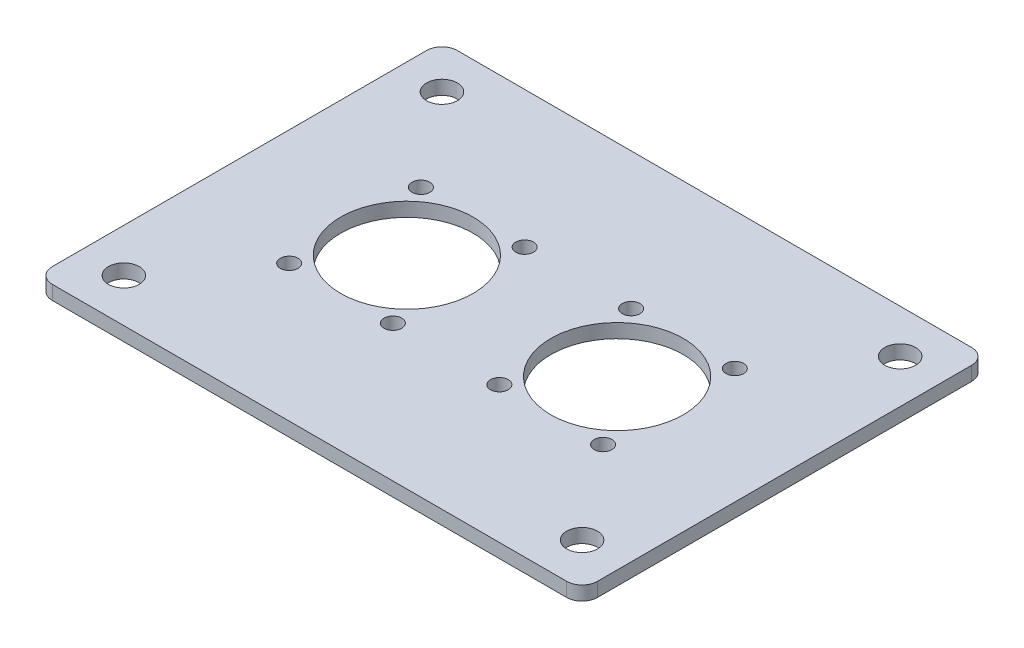
ISO-10303-21;
HEADER;
FILE_DESCRIPTION(('STEP AP214'),'2;1');
FILE_NAME('part.step','',(''),(''),'','','');
FILE_SCHEMA(('AUTOMOTIVE_DESIGN { 1 0 10303 214 1 1 1 1 }'));
ENDSEC;
DATA;
#1=APPLICATION_CONTEXT('core data for automotive mechanical design processes');
#2=APPLICATION_PROTOCOL_DEFINITION('international standard','automotive_design',2000,#1);
#3=PRODUCT_CONTEXT('',#1,'mechanical');
#4=PRODUCT('Part','Part','',(#3));
#5=PRODUCT_RELATED_PRODUCT_CATEGORY('part','',(#4));
#6=PRODUCT_DEFINITION_FORMATION('','',#4);
#7=PRODUCT_DEFINITION_CONTEXT('part definition',#1,'design');
#8=PRODUCT_DEFINITION('design','',#6,#7);
#9=PRODUCT_DEFINITION_SHAPE('','',#8);
#10=(LENGTH_UNIT() NAMED_UNIT(*) SI_UNIT(.MILLI.,.METRE.));
#11=(NAMED_UNIT(*) PLANE_ANGLE_UNIT() SI_UNIT($,.RADIAN.));
#12=(NAMED_UNIT(*) SI_UNIT($,.STERADIAN.) SOLID_ANGLE_UNIT());
#13=UNCERTAINTY_MEASURE_WITH_UNIT(LENGTH_MEASURE(1.E-05),#10,'distance_accuracy_value','');
#14=(GEOMETRIC_REPRESENTATION_CONTEXT(3) GLOBAL_UNCERTAINTY_ASSIGNED_CONTEXT((#13)) GLOBAL_UNIT_ASSIGNED_CONTEXT((#10,
#11,#12)) REPRESENTATION_CONTEXT('',''));
#15=CARTESIAN_POINT('',(0.,0.,0.));
#16=DIRECTION('',(0.,0.,1.));
#17=DIRECTION('',(1.,0.,0.));
#18=AXIS2_PLACEMENT_3D('',#15,#16,#17);
#19=CARTESIAN_POINT('',(46.609,2.54,-33.909));
#20=DIRECTION('',(0.,-1.,0.));
#21=DIRECTION('',(0.,0.,-1.));
#22=AXIS2_PLACEMENT_3D('',#19,#20,#21);
#23=PLANE('',#22);
#24=CARTESIAN_POINT('',(46.609,2.54,-33.909));
#25=DIRECTION('',(0.,1.,0.));
#26=DIRECTION('',(0.,0.,-1.));
#27=AXIS2_PLACEMENT_3D('',#24,#25,#26);
#28=CIRCLE('',#27,2.794);
#29=CARTESIAN_POINT('',(49.403,2.54,-33.909));
#30=VERTEX_POINT('',#29);
#31=CARTESIAN_POINT('',(46.609,2.54,-36.703));
#32=VERTEX_POINT('',#31);
#33=EDGE_CURVE('E166',#30,#32,#28,.T.);
#34=ORIENTED_EDGE('',*,*,#33,.T.);
#35=DIRECTION('',(-1.,0.,0.));
#36=VECTOR('',#35,1.);
#37=CARTESIAN_POINT('',(-46.609,2.54,-36.703));
#38=LINE('',#37,#36);
#39=CARTESIAN_POINT('',(-46.609,2.54,-36.703));
#40=VERTEX_POINT('',#39);
#41=EDGE_CURVE('E101',#32,#40,#38,.T.);
#42=ORIENTED_EDGE('',*,*,#41,.T.);
#43=CARTESIAN_POINT('',(-46.609,2.54,-33.909));
#44=DIRECTION('',(0.,1.,0.));
#45=DIRECTION('',(0.,0.,-1.));
#46=AXIS2_PLACEMENT_3D('',#43,#44,#45);
#47=CIRCLE('',#46,2.794);
#48=CARTESIAN_POINT('',(-49.403,2.54,-33.909));
#49=VERTEX_POINT('',#48);
#50=EDGE_CURVE('E188',#40,#49,#47,.T.);
#51=ORIENTED_EDGE('',*,*,#50,.T.);
#52=DIRECTION('',(0.,0.,1.));
#53=VECTOR('',#52,1.);
#54=CARTESIAN_POINT('',(-49.403,2.54,33.909));
#55=LINE('',#54,#53);
#56=CARTESIAN_POINT('',(-49.403,2.54,33.909));
#57=VERTEX_POINT('',#56);
#58=EDGE_CURVE('E202',#49,#57,#55,.T.);
#59=ORIENTED_EDGE('',*,*,#58,.T.);
#60=CARTESIAN_POINT('',(-46.609,2.54,33.909));
#61=DIRECTION('',(0.,1.,0.));
#62=DIRECTION('',(0.,0.,-1.));
#63=AXIS2_PLACEMENT_3D('',#60,#61,#62);
#64=CIRCLE('',#63,2.794);
#65=CARTESIAN_POINT('',(-46.609,2.54,36.703));
#66=VERTEX_POINT('',#65);
#67=EDGE_CURVE('E120',#57,#66,#64,.T.);
#68=ORIENTED_EDGE('',*,*,#67,.T.);
#69=DIRECTION('',(1.,0.,0.));
#70=VECTOR('',#69,1.);
#71=CARTESIAN_POINT('',(-46.609,2.54,36.703));
#72=LINE('',#71,#70);
#73=CARTESIAN_POINT('',(46.609,2.54,36.703));
#74=VERTEX_POINT('',#73);
#75=EDGE_CURVE('E114',#66,#74,#72,.T.);
#76=ORIENTED_EDGE('',*,*,#75,.T.);
#77=CARTESIAN_POINT('',(46.609,2.54,33.909));
#78=DIRECTION('',(0.,1.,0.));
#79=DIRECTION('',(0.,0.,1.));
#80=AXIS2_PLACEMENT_3D('',#77,#78,#79);
#81=CIRCLE('',#80,2.794);
#82=CARTESIAN_POINT('',(49.403,2.54,33.909));
#83=VERTEX_POINT('',#82);
#84=EDGE_CURVE('E118',#74,#83,#81,.T.);
#85=ORIENTED_EDGE('',*,*,#84,.T.);
#86=DIRECTION('',(0.,0.,-1.));
#87=VECTOR('',#86,1.);
#88=CARTESIAN_POINT('',(49.403,2.54,33.909));
#89=LINE('',#88,#87);
#90=EDGE_CURVE('E58',#83,#30,#89,.T.);
#91=ORIENTED_EDGE('',*,*,#90,.T.);
#92=EDGE_LOOP('',(#34,#42,#51,#59,#68,#76,#85,#91));
#93=FACE_BOUND('',#92,.T.);
#94=CARTESIAN_POINT('',(-19.05,2.54,0.));
#95=DIRECTION('',(0.,1.,0.));
#96=DIRECTION('',(0.,0.,1.));
#97=AXIS2_PLACEMENT_3D('',#94,#95,#96);
#98=CIRCLE('',#97,12.0015);
#99=CARTESIAN_POINT('',(-19.05,2.54,12.0015));
#100=VERTEX_POINT('',#99);
#101=EDGE_CURVE('E148',#100,#100,#98,.T.);
#102=ORIENTED_EDGE('',*,*,#101,.F.);
#103=EDGE_LOOP('',(#102));
#104=FACE_BOUND('',#103,.T.);
#105=CARTESIAN_POINT('',(19.05,2.54,0.));
#106=DIRECTION('',(0.,1.,0.));
#107=DIRECTION('',(0.,0.,1.));
#108=AXIS2_PLACEMENT_3D('',#105,#106,#107);
#109=CIRCLE('',#108,12.0015);
#110=CARTESIAN_POINT('',(19.05,2.54,12.0015));
#111=VERTEX_POINT('',#110);
#112=EDGE_CURVE('E217',#111,#111,#109,.T.);
#113=ORIENTED_EDGE('',*,*,#112,.F.);
#114=EDGE_LOOP('',(#113));
#115=FACE_BOUND('',#114,.T.);
#116=CARTESIAN_POINT('',(-41.529,2.54,-28.829));
#117=DIRECTION('',(0.,1.,0.));
#118=DIRECTION('',(0.,0.,1.));
#119=AXIS2_PLACEMENT_3D('',#116,#117,#118);
#120=CIRCLE('',#119,2.794);
#121=CARTESIAN_POINT('',(-41.529,2.54,-26.035));
#122=VERTEX_POINT('',#121);
#123=EDGE_CURVE('E225',#122,#122,#120,.T.);
#124=ORIENTED_EDGE('',*,*,#123,.F.);
#125=EDGE_LOOP('',(#124));
#126=FACE_BOUND('',#125,.T.);
#127=CARTESIAN_POINT('',(-28.448,2.54,11.938));
#128=DIRECTION('',(0.,1.,0.));
#129=DIRECTION('',(0.,0.,1.));
#130=AXIS2_PLACEMENT_3D('',#127,#128,#129);
#131=CIRCLE('',#130,1.6002);
#132=CARTESIAN_POINT('',(-28.448,2.54,13.5382));
#133=VERTEX_POINT('',#132);
#134=EDGE_CURVE('E233',#133,#133,#131,.T.);
#135=ORIENTED_EDGE('',*,*,#134,.F.);
#136=EDGE_LOOP('',(#135));
#137=FACE_BOUND('',#136,.T.);
#138=CARTESIAN_POINT('',(9.652,2.54,11.938));
#139=DIRECTION('',(0.,1.,0.));
#140=DIRECTION('',(0.,0.,1.));
#141=AXIS2_PLACEMENT_3D('',#138,#139,#140);
#142=CIRCLE('',#141,1.6002);
#143=CARTESIAN_POINT('',(9.652,2.54,13.5382));
#144=VERTEX_POINT('',#143);
#145=EDGE_CURVE('E241',#144,#144,#142,.T.);
#146=ORIENTED_EDGE('',*,*,#145,.F.);
#147=EDGE_LOOP('',(#146));
#148=FACE_BOUND('',#147,.T.);
#149=CARTESIAN_POINT('',(-9.652,2.54,11.938));
#150=DIRECTION('',(0.,1.,0.));
#151=DIRECTION('',(0.,0.,1.));
#152=AXIS2_PLACEMENT_3D('',#149,#150,#151);
#153=CIRCLE('',#152,1.6002);
#154=CARTESIAN_POINT('',(-9.652,2.54,13.5382));
#155=VERTEX_POINT('',#154);
#156=EDGE_CURVE('E249',#155,#155,#153,.T.);
#157=ORIENTED_EDGE('',*,*,#156,.F.);
#158=EDGE_LOOP('',(#157));
#159=FACE_BOUND('',#158,.T.);
#160=CARTESIAN_POINT('',(-9.65200000000008,2.54,-11.938));
#161=DIRECTION('',(0.,1.,0.));
#162=DIRECTION('',(0.,0.,1.));
#163=AXIS2_PLACEMENT_3D('',#160,#161,#162);
#164=CIRCLE('',#163,1.6002);
#165=CARTESIAN_POINT('',(-9.65200000000008,2.54,-10.3378));
#166=VERTEX_POINT('',#165);
#167=EDGE_CURVE('E257',#166,#166,#164,.T.);
#168=ORIENTED_EDGE('',*,*,#167,.F.);
#169=EDGE_LOOP('',(#168));
#170=FACE_BOUND('',#169,.T.);
#171=CARTESIAN_POINT('',(-28.4480000000001,2.54,-11.938));
#172=DIRECTION('',(0.,1.,0.));
#173=DIRECTION('',(0.,0.,1.));
#174=AXIS2_PLACEMENT_3D('',#171,#172,#173);
#175=CIRCLE('',#174,1.6002);
#176=CARTESIAN_POINT('',(-28.4480000000001,2.54,-10.3378));
#177=VERTEX_POINT('',#176);
#178=EDGE_CURVE('E265',#177,#177,#175,.T.);
#179=ORIENTED_EDGE('',*,*,#178,.F.);
#180=EDGE_LOOP('',(#179));
#181=FACE_BOUND('',#180,.T.);
#182=CARTESIAN_POINT('',(28.448,2.54,11.938));
#183=DIRECTION('',(0.,1.,0.));
#184=DIRECTION('',(0.,0.,1.));
#185=AXIS2_PLACEMENT_3D('',#182,#183,#184);
#186=CIRCLE('',#185,1.6002);
#187=CARTESIAN_POINT('',(28.448,2.54,13.5382));
#188=VERTEX_POINT('',#187);
#189=EDGE_CURVE('E273',#188,#188,#186,.T.);
#190=ORIENTED_EDGE('',*,*,#189,.F.);
#191=EDGE_LOOP('',(#190));
#192=FACE_BOUND('',#191,.T.);
#193=CARTESIAN_POINT('',(28.4479999999999,2.54,-11.938));
#194=DIRECTION('',(0.,1.,0.));
#195=DIRECTION('',(0.,0.,1.));
#196=AXIS2_PLACEMENT_3D('',#193,#194,#195);
#197=CIRCLE('',#196,1.6002);
#198=CARTESIAN_POINT('',(28.4479999999999,2.54,-10.3378));
#199=VERTEX_POINT('',#198);
#200=EDGE_CURVE('E281',#199,#199,#197,.T.);
#201=ORIENTED_EDGE('',*,*,#200,.F.);
#202=EDGE_LOOP('',(#201));
#203=FACE_BOUND('',#202,.T.);
#204=CARTESIAN_POINT('',(9.65199999999992,2.54,-11.938));
#205=DIRECTION('',(0.,1.,0.));
#206=DIRECTION('',(0.,0.,1.));
#207=AXIS2_PLACEMENT_3D('',#204,#205,#206);
#208=CIRCLE('',#207,1.6002);
#209=CARTESIAN_POINT('',(9.65199999999992,2.54,-10.3378));
#210=VERTEX_POINT('',#209);
#211=EDGE_CURVE('E289',#210,#210,#208,.T.);
#212=ORIENTED_EDGE('',*,*,#211,.F.);
#213=EDGE_LOOP('',(#212));
#214=FACE_BOUND('',#213,.T.);
#215=CARTESIAN_POINT('',(41.529,2.54,-28.829));
#216=DIRECTION('',(0.,1.,0.));
#217=DIRECTION('',(0.,0.,1.));
#218=AXIS2_PLACEMENT_3D('',#215,#216,#217);
#219=CIRCLE('',#218,2.794);
#220=CARTESIAN_POINT('',(41.529,2.54,-26.035));
#221=VERTEX_POINT('',#220);
#222=EDGE_CURVE('E297',#221,#221,#219,.T.);
#223=ORIENTED_EDGE('',*,*,#222,.F.);
#224=EDGE_LOOP('',(#223));
#225=FACE_BOUND('',#224,.T.);
#226=CARTESIAN_POINT('',(41.529,2.54,28.829));
#227=DIRECTION('',(0.,1.,0.));
#228=DIRECTION('',(0.,0.,1.));
#229=AXIS2_PLACEMENT_3D('',#226,#227,#228);
#230=CIRCLE('',#229,2.794);
#231=CARTESIAN_POINT('',(41.529,2.54,31.623));
#232=VERTEX_POINT('',#231);
#233=EDGE_CURVE('E305',#232,#232,#230,.T.);
#234=ORIENTED_EDGE('',*,*,#233,.F.);
#235=EDGE_LOOP('',(#234));
#236=FACE_BOUND('',#235,.T.);
#237=CARTESIAN_POINT('',(-41.529,2.54,28.829));
#238=DIRECTION('',(0.,1.,0.));
#239=DIRECTION('',(0.,0.,1.));
#240=AXIS2_PLACEMENT_3D('',#237,#238,#239);
#241=CIRCLE('',#240,2.794);
#242=CARTESIAN_POINT('',(-41.529,2.54,31.623));
#243=VERTEX_POINT('',#242);
#244=EDGE_CURVE('E313',#243,#243,#241,.T.);
#245=ORIENTED_EDGE('',*,*,#244,.F.);
#246=EDGE_LOOP('',(#245));
#247=FACE_BOUND('',#246,.T.);
#248=ADVANCED_FACE('F40',(#93,#104,#115,#126,#137,#148,#159,#170,#181,#192,#203,#214,#225,#236,
#247),#23,.F.);
#249=CARTESIAN_POINT('',(46.609,0.,-33.909));
#250=DIRECTION('',(0.,-1.,0.));
#251=DIRECTION('',(0.,0.,-1.));
#252=AXIS2_PLACEMENT_3D('',#249,#250,#251);
#253=PLANE('',#252);
#254=CARTESIAN_POINT('',(41.529,0.,28.829));
#255=DIRECTION('',(0.,1.,0.));
#256=DIRECTION('',(0.,0.,1.));
#257=AXIS2_PLACEMENT_3D('',#254,#255,#256);
#258=CIRCLE('',#257,2.794);
#259=CARTESIAN_POINT('',(41.529,0.,31.623));
#260=VERTEX_POINT('',#259);
#261=EDGE_CURVE('E309',#260,#260,#258,.T.);
#262=ORIENTED_EDGE('',*,*,#261,.T.);
#263=EDGE_LOOP('',(#262));
#264=FACE_BOUND('',#263,.T.);
#265=CARTESIAN_POINT('',(9.65199999999992,0.,-11.938));
#266=DIRECTION('',(0.,1.,0.));
#267=DIRECTION('',(0.,0.,1.));
#268=AXIS2_PLACEMENT_3D('',#265,#266,#267);
#269=CIRCLE('',#268,1.6002);
#270=CARTESIAN_POINT('',(9.65199999999992,0.,-10.3378));
#271=VERTEX_POINT('',#270);
#272=EDGE_CURVE('E293',#271,#271,#269,.T.);
#273=ORIENTED_EDGE('',*,*,#272,.T.);
#274=EDGE_LOOP('',(#273));
#275=FACE_BOUND('',#274,.T.);
#276=CARTESIAN_POINT('',(28.448,0.,11.938));
#277=DIRECTION('',(0.,1.,0.));
#278=DIRECTION('',(0.,0.,1.));
#279=AXIS2_PLACEMENT_3D('',#276,#277,#278);
#280=CIRCLE('',#279,1.6002);
#281=CARTESIAN_POINT('',(28.448,0.,13.5382));
#282=VERTEX_POINT('',#281);
#283=EDGE_CURVE('E277',#282,#282,#280,.T.);
#284=ORIENTED_EDGE('',*,*,#283,.T.);
#285=EDGE_LOOP('',(#284));
#286=FACE_BOUND('',#285,.T.);
#287=CARTESIAN_POINT('',(-9.65200000000008,0.,-11.938));
#288=DIRECTION('',(0.,1.,0.));
#289=DIRECTION('',(0.,0.,1.));
#290=AXIS2_PLACEMENT_3D('',#287,#288,#289);
#291=CIRCLE('',#290,1.6002);
#292=CARTESIAN_POINT('',(-9.65200000000008,0.,-10.3378));
#293=VERTEX_POINT('',#292);
#294=EDGE_CURVE('E261',#293,#293,#291,.T.);
#295=ORIENTED_EDGE('',*,*,#294,.T.);
#296=EDGE_LOOP('',(#295));
#297=FACE_BOUND('',#296,.T.);
#298=CARTESIAN_POINT('',(9.652,0.,11.938));
#299=DIRECTION('',(0.,1.,0.));
#300=DIRECTION('',(0.,0.,1.));
#301=AXIS2_PLACEMENT_3D('',#298,#299,#300);
#302=CIRCLE('',#301,1.6002);
#303=CARTESIAN_POINT('',(9.652,0.,13.5382));
#304=VERTEX_POINT('',#303);
#305=EDGE_CURVE('E245',#304,#304,#302,.T.);
#306=ORIENTED_EDGE('',*,*,#305,.T.);
#307=EDGE_LOOP('',(#306));
#308=FACE_BOUND('',#307,.T.);
#309=CARTESIAN_POINT('',(-41.529,0.,-28.829));
#310=DIRECTION('',(0.,1.,0.));
#311=DIRECTION('',(0.,0.,1.));
#312=AXIS2_PLACEMENT_3D('',#309,#310,#311);
#313=CIRCLE('',#312,2.794);
#314=CARTESIAN_POINT('',(-41.529,0.,-26.035));
#315=VERTEX_POINT('',#314);
#316=EDGE_CURVE('E229',#315,#315,#313,.T.);
#317=ORIENTED_EDGE('',*,*,#316,.T.);
#318=EDGE_LOOP('',(#317));
#319=FACE_BOUND('',#318,.T.);
#320=CARTESIAN_POINT('',(-19.05,0.,0.));
#321=DIRECTION('',(0.,1.,0.));
#322=DIRECTION('',(0.,0.,1.));
#323=AXIS2_PLACEMENT_3D('',#320,#321,#322);
#324=CIRCLE('',#323,12.0015);
#325=CARTESIAN_POINT('',(-19.05,0.,12.0015));
#326=VERTEX_POINT('',#325);
#327=EDGE_CURVE('E213',#326,#326,#324,.T.);
#328=ORIENTED_EDGE('',*,*,#327,.T.);
#329=EDGE_LOOP('',(#328));
#330=FACE_BOUND('',#329,.T.);
#331=CARTESIAN_POINT('',(46.609,0.,-33.909));
#332=DIRECTION('',(0.,1.,0.));
#333=DIRECTION('',(0.,0.,-1.));
#334=AXIS2_PLACEMENT_3D('',#331,#332,#333);
#335=CIRCLE('',#334,2.794);
#336=CARTESIAN_POINT('',(49.403,0.,-33.909));
#337=VERTEX_POINT('',#336);
#338=CARTESIAN_POINT('',(46.609,0.,-36.703));
#339=VERTEX_POINT('',#338);
#340=EDGE_CURVE('E143',#337,#339,#335,.T.);
#341=ORIENTED_EDGE('',*,*,#340,.F.);
#342=DIRECTION('',(0.,0.,-1.));
#343=VECTOR('',#342,1.);
#344=CARTESIAN_POINT('',(49.403,0.,33.909));
#345=LINE('',#344,#343);
#346=CARTESIAN_POINT('',(49.403,0.,33.909));
#347=VERTEX_POINT('',#346);
#348=EDGE_CURVE('E93',#347,#337,#345,.T.);
#349=ORIENTED_EDGE('',*,*,#348,.F.);
#350=CARTESIAN_POINT('',(46.609,0.,33.909));
#351=DIRECTION('',(0.,1.,0.));
#352=DIRECTION('',(0.,0.,1.));
#353=AXIS2_PLACEMENT_3D('',#350,#351,#352);
#354=CIRCLE('',#353,2.794);
#355=CARTESIAN_POINT('',(46.609,0.,36.703));
#356=VERTEX_POINT('',#355);
#357=EDGE_CURVE('E87',#356,#347,#354,.T.);
#358=ORIENTED_EDGE('',*,*,#357,.F.);
#359=DIRECTION('',(1.,0.,0.));
#360=VECTOR('',#359,1.);
#361=CARTESIAN_POINT('',(-46.609,0.,36.703));
#362=LINE('',#361,#360);
#363=CARTESIAN_POINT('',(-46.609,0.,36.703));
#364=VERTEX_POINT('',#363);
#365=EDGE_CURVE('E129',#364,#356,#362,.T.);
#366=ORIENTED_EDGE('',*,*,#365,.F.);
#367=CARTESIAN_POINT('',(-46.609,0.,33.909));
#368=DIRECTION('',(0.,1.,0.));
#369=DIRECTION('',(0.,0.,-1.));
#370=AXIS2_PLACEMENT_3D('',#367,#368,#369);
#371=CIRCLE('',#370,2.794);
#372=CARTESIAN_POINT('',(-49.403,0.,33.909));
#373=VERTEX_POINT('',#372);
#374=EDGE_CURVE('E157',#373,#364,#371,.T.);
#375=ORIENTED_EDGE('',*,*,#374,.F.);
#376=DIRECTION('',(0.,0.,1.));
#377=VECTOR('',#376,1.);
#378=CARTESIAN_POINT('',(-49.403,0.,33.909));
#379=LINE('',#378,#377);
#380=CARTESIAN_POINT('',(-49.403,0.,-33.909));
#381=VERTEX_POINT('',#380);
#382=EDGE_CURVE('E154',#381,#373,#379,.T.);
#383=ORIENTED_EDGE('',*,*,#382,.F.);
#384=CARTESIAN_POINT('',(-46.609,0.,-33.909));
#385=DIRECTION('',(0.,1.,0.));
#386=DIRECTION('',(0.,0.,-1.));
#387=AXIS2_PLACEMENT_3D('',#384,#385,#386);
#388=CIRCLE('',#387,2.794);
#389=CARTESIAN_POINT('',(-46.609,0.,-36.703));
#390=VERTEX_POINT('',#389);
#391=EDGE_CURVE('E151',#390,#381,#388,.T.);
#392=ORIENTED_EDGE('',*,*,#391,.F.);
#393=DIRECTION('',(-1.,0.,0.));
#394=VECTOR('',#393,1.);
#395=CARTESIAN_POINT('',(-46.609,0.,-36.703));
#396=LINE('',#395,#394);
#397=EDGE_CURVE('E147',#339,#390,#396,.T.);
#398=ORIENTED_EDGE('',*,*,#397,.F.);
#399=EDGE_LOOP('',(#341,#349,#358,#366,#375,#383,#392,#398));
#400=FACE_BOUND('',#399,.T.);
#401=CARTESIAN_POINT('',(19.05,0.,0.));
#402=DIRECTION('',(0.,1.,0.));
#403=DIRECTION('',(0.,0.,1.));
#404=AXIS2_PLACEMENT_3D('',#401,#402,#403);
#405=CIRCLE('',#404,12.0015);
#406=CARTESIAN_POINT('',(19.05,0.,12.0015));
#407=VERTEX_POINT('',#406);
#408=EDGE_CURVE('E221',#407,#407,#405,.T.);
#409=ORIENTED_EDGE('',*,*,#408,.T.);
#410=EDGE_LOOP('',(#409));
#411=FACE_BOUND('',#410,.T.);
#412=CARTESIAN_POINT('',(-28.448,0.,11.938));
#413=DIRECTION('',(0.,1.,0.));
#414=DIRECTION('',(0.,0.,1.));
#415=AXIS2_PLACEMENT_3D('',#412,#413,#414);
#416=CIRCLE('',#415,1.6002);
#417=CARTESIAN_POINT('',(-28.448,0.,13.5382));
#418=VERTEX_POINT('',#417);
#419=EDGE_CURVE('E237',#418,#418,#416,.T.);
#420=ORIENTED_EDGE('',*,*,#419,.T.);
#421=EDGE_LOOP('',(#420));
#422=FACE_BOUND('',#421,.T.);
#423=CARTESIAN_POINT('',(-9.652,0.,11.938));
#424=DIRECTION('',(0.,1.,0.));
#425=DIRECTION('',(0.,0.,1.));
#426=AXIS2_PLACEMENT_3D('',#423,#424,#425);
#427=CIRCLE('',#426,1.6002);
#428=CARTESIAN_POINT('',(-9.652,0.,13.5382));
#429=VERTEX_POINT('',#428);
#430=EDGE_CURVE('E253',#429,#429,#427,.T.);
#431=ORIENTED_EDGE('',*,*,#430,.T.);
#432=EDGE_LOOP('',(#431));
#433=FACE_BOUND('',#432,.T.);
#434=CARTESIAN_POINT('',(-28.4480000000001,0.,-11.938));
#435=DIRECTION('',(0.,1.,0.));
#436=DIRECTION('',(0.,0.,1.));
#437=AXIS2_PLACEMENT_3D('',#434,#435,#436);
#438=CIRCLE('',#437,1.6002);
#439=CARTESIAN_POINT('',(-28.4480000000001,0.,-10.3378));
#440=VERTEX_POINT('',#439);
#441=EDGE_CURVE('E269',#440,#440,#438,.T.);
#442=ORIENTED_EDGE('',*,*,#441,.T.);
#443=EDGE_LOOP('',(#442));
#444=FACE_BOUND('',#443,.T.);
#445=CARTESIAN_POINT('',(28.4479999999999,0.,-11.938));
#446=DIRECTION('',(0.,1.,0.));
#447=DIRECTION('',(0.,0.,1.));
#448=AXIS2_PLACEMENT_3D('',#445,#446,#447);
#449=CIRCLE('',#448,1.6002);
#450=CARTESIAN_POINT('',(28.4479999999999,0.,-10.3378));
#451=VERTEX_POINT('',#450);
#452=EDGE_CURVE('E285',#451,#451,#449,.T.);
#453=ORIENTED_EDGE('',*,*,#452,.T.);
#454=EDGE_LOOP('',(#453));
#455=FACE_BOUND('',#454,.T.);
#456=CARTESIAN_POINT('',(41.529,0.,-28.829));
#457=DIRECTION('',(0.,1.,0.));
#458=DIRECTION('',(0.,0.,1.));
#459=AXIS2_PLACEMENT_3D('',#456,#457,#458);
#460=CIRCLE('',#459,2.794);
#461=CARTESIAN_POINT('',(41.529,0.,-26.035));
#462=VERTEX_POINT('',#461);
#463=EDGE_CURVE('E301',#462,#462,#460,.T.);
#464=ORIENTED_EDGE('',*,*,#463,.T.);
#465=EDGE_LOOP('',(#464));
#466=FACE_BOUND('',#465,.T.);
#467=CARTESIAN_POINT('',(-41.529,0.,28.829));
#468=DIRECTION('',(0.,1.,0.));
#469=DIRECTION('',(0.,0.,1.));
#470=AXIS2_PLACEMENT_3D('',#467,#468,#469);
#471=CIRCLE('',#470,2.794);
#472=CARTESIAN_POINT('',(-41.529,0.,31.623));
#473=VERTEX_POINT('',#472);
#474=EDGE_CURVE('E317',#473,#473,#471,.T.);
#475=ORIENTED_EDGE('',*,*,#474,.T.);
#476=EDGE_LOOP('',(#475));
#477=FACE_BOUND('',#476,.T.);
#478=ADVANCED_FACE('F192',(#264,#275,#286,#297,#308,#319,#330,#400,#411,#422,#433,#444,#455,
#466,#477),#253,.T.);
#479=CARTESIAN_POINT('',(46.609,2.54,-33.909));
#480=DIRECTION('',(0.,-1.,0.));
#481=DIRECTION('',(0.,0.,-1.));
#482=AXIS2_PLACEMENT_3D('',#479,#480,#481);
#483=CYLINDRICAL_SURFACE('',#482,2.794);
#484=ORIENTED_EDGE('',*,*,#340,.T.);
#485=DIRECTION('',(0.,-1.,0.));
#486=VECTOR('',#485,1.);
#487=CARTESIAN_POINT('',(46.609,2.54,-36.703));
#488=LINE('',#487,#486);
#489=EDGE_CURVE('E11',#32,#339,#488,.T.);
#490=ORIENTED_EDGE('',*,*,#489,.F.);
#491=ORIENTED_EDGE('',*,*,#33,.F.);
#492=DIRECTION('',(0.,-1.,0.));
#493=VECTOR('',#492,1.);
#494=CARTESIAN_POINT('',(49.403,2.54,-33.909));
#495=LINE('',#494,#493);
#496=EDGE_CURVE('E139',#30,#337,#495,.T.);
#497=ORIENTED_EDGE('',*,*,#496,.T.);
#498=EDGE_LOOP('',(#484,#490,#491,#497));
#499=FACE_BOUND('',#498,.T.);
#500=ADVANCED_FACE('F42',(#499),#483,.T.);
#501=CARTESIAN_POINT('',(-46.609,2.54,-36.703));
#502=DIRECTION('',(0.,0.,1.));
#503=DIRECTION('',(1.,0.,0.));
#504=AXIS2_PLACEMENT_3D('',#501,#502,#503);
#505=PLANE('',#504);
#506=ORIENTED_EDGE('',*,*,#397,.T.);
#507=DIRECTION('',(0.,-1.,0.));
#508=VECTOR('',#507,1.);
#509=CARTESIAN_POINT('',(-46.609,2.54,-36.703));
#510=LINE('',#509,#508);
#511=EDGE_CURVE('E50',#40,#390,#510,.T.);
#512=ORIENTED_EDGE('',*,*,#511,.F.);
#513=ORIENTED_EDGE('',*,*,#41,.F.);
#514=ORIENTED_EDGE('',*,*,#489,.T.);
#515=EDGE_LOOP('',(#506,#512,#513,#514));
#516=FACE_BOUND('',#515,.T.);
#517=ADVANCED_FACE('F352',(#516),#505,.F.);
#518=CARTESIAN_POINT('',(-46.609,2.54,-33.909));
#519=DIRECTION('',(0.,-1.,0.));
#520=DIRECTION('',(0.,0.,-1.));
#521=AXIS2_PLACEMENT_3D('',#518,#519,#520);
#522=CYLINDRICAL_SURFACE('',#521,2.794);
#523=ORIENTED_EDGE('',*,*,#391,.T.);
#524=DIRECTION('',(0.,-1.,0.));
#525=VECTOR('',#524,1.);
#526=CARTESIAN_POINT('',(-49.403,2.54,-33.909));
#527=LINE('',#526,#525);
#528=EDGE_CURVE('E177',#49,#381,#527,.T.);
#529=ORIENTED_EDGE('',*,*,#528,.F.);
#530=ORIENTED_EDGE('',*,*,#50,.F.);
#531=ORIENTED_EDGE('',*,*,#511,.T.);
#532=EDGE_LOOP('',(#523,#529,#530,#531));
#533=FACE_BOUND('',#532,.T.);
#534=ADVANCED_FACE('F186',(#533),#522,.T.);
#535=CARTESIAN_POINT('',(-49.403,2.54,33.909));
#536=DIRECTION('',(1.,0.,0.));
#537=DIRECTION('',(0.,0.,-1.));
#538=AXIS2_PLACEMENT_3D('',#535,#536,#537);
#539=PLANE('',#538);
#540=ORIENTED_EDGE('',*,*,#382,.T.);
#541=DIRECTION('',(0.,-1.,0.));
#542=VECTOR('',#541,1.);
#543=CARTESIAN_POINT('',(-49.403,2.54,33.909));
#544=LINE('',#543,#542);
#545=EDGE_CURVE('E173',#57,#373,#544,.T.);
#546=ORIENTED_EDGE('',*,*,#545,.F.);
#547=ORIENTED_EDGE('',*,*,#58,.F.);
#548=ORIENTED_EDGE('',*,*,#528,.T.);
#549=EDGE_LOOP('',(#540,#546,#547,#548));
#550=FACE_BOUND('',#549,.T.);
#551=ADVANCED_FACE('F197',(#550),#539,.F.);
#552=CARTESIAN_POINT('',(-46.609,2.54,33.909));
#553=DIRECTION('',(0.,-1.,0.));
#554=DIRECTION('',(0.,0.,-1.));
#555=AXIS2_PLACEMENT_3D('',#552,#553,#554);
#556=CYLINDRICAL_SURFACE('',#555,2.794);
#557=ORIENTED_EDGE('',*,*,#374,.T.);
#558=DIRECTION('',(0.,-1.,0.));
#559=VECTOR('',#558,1.);
#560=CARTESIAN_POINT('',(-46.609,2.54,36.703));
#561=LINE('',#560,#559);
#562=EDGE_CURVE('E131',#66,#364,#561,.T.);
#563=ORIENTED_EDGE('',*,*,#562,.F.);
#564=ORIENTED_EDGE('',*,*,#67,.F.);
#565=ORIENTED_EDGE('',*,*,#545,.T.);
#566=EDGE_LOOP('',(#557,#563,#564,#565));
#567=FACE_BOUND('',#566,.T.);
#568=ADVANCED_FACE('F200',(#567),#556,.T.);
#569=CARTESIAN_POINT('',(-46.609,2.54,36.703));
#570=DIRECTION('',(0.,0.,-1.));
#571=DIRECTION('',(-1.,0.,0.));
#572=AXIS2_PLACEMENT_3D('',#569,#570,#571);
#573=PLANE('',#572);
#574=ORIENTED_EDGE('',*,*,#365,.T.);
#575=DIRECTION('',(0.,-1.,0.));
#576=VECTOR('',#575,1.);
#577=CARTESIAN_POINT('',(46.609,2.54,36.703));
#578=LINE('',#577,#576);
#579=EDGE_CURVE('E126',#74,#356,#578,.T.);
#580=ORIENTED_EDGE('',*,*,#579,.F.);
#581=ORIENTED_EDGE('',*,*,#75,.F.);
#582=ORIENTED_EDGE('',*,*,#562,.T.);
#583=EDGE_LOOP('',(#574,#580,#581,#582));
#584=FACE_BOUND('',#583,.T.);
#585=ADVANCED_FACE('F127',(#584),#573,.F.);
#586=CARTESIAN_POINT('',(46.609,2.54,33.909));
#587=DIRECTION('',(0.,-1.,0.));
#588=DIRECTION('',(0.,0.,-1.));
#589=AXIS2_PLACEMENT_3D('',#586,#587,#588);
#590=CYLINDRICAL_SURFACE('',#589,2.794);
#591=ORIENTED_EDGE('',*,*,#357,.T.);
#592=DIRECTION('',(0.,-1.,0.));
#593=VECTOR('',#592,1.);
#594=CARTESIAN_POINT('',(49.403,2.54,33.909));
#595=LINE('',#594,#593);
#596=EDGE_CURVE('E132',#83,#347,#595,.T.);
#597=ORIENTED_EDGE('',*,*,#596,.F.);
#598=ORIENTED_EDGE('',*,*,#84,.F.);
#599=ORIENTED_EDGE('',*,*,#579,.T.);
#600=EDGE_LOOP('',(#591,#597,#598,#599));
#601=FACE_BOUND('',#600,.T.);
#602=ADVANCED_FACE('F134',(#601),#590,.T.);
#603=CARTESIAN_POINT('',(49.403,2.54,33.909));
#604=DIRECTION('',(-1.,0.,0.));
#605=DIRECTION('',(0.,0.,1.));
#606=AXIS2_PLACEMENT_3D('',#603,#604,#605);
#607=PLANE('',#606);
#608=ORIENTED_EDGE('',*,*,#348,.T.);
#609=ORIENTED_EDGE('',*,*,#496,.F.);
#610=ORIENTED_EDGE('',*,*,#90,.F.);
#611=ORIENTED_EDGE('',*,*,#596,.T.);
#612=EDGE_LOOP('',(#608,#609,#610,#611));
#613=FACE_BOUND('',#612,.T.);
#614=ADVANCED_FACE('F340',(#613),#607,.F.);
#615=CARTESIAN_POINT('',(-19.05,2.54,0.));
#616=DIRECTION('',(0.,-1.,0.));
#617=DIRECTION('',(0.,0.,-1.));
#618=AXIS2_PLACEMENT_3D('',#615,#616,#617);
#619=CYLINDRICAL_SURFACE('',#618,12.0015);
#620=ORIENTED_EDGE('',*,*,#101,.T.);
#621=EDGE_LOOP('',(#620));
#622=FACE_BOUND('',#621,.T.);
#623=ORIENTED_EDGE('',*,*,#327,.F.);
#624=EDGE_LOOP('',(#623));
#625=FACE_BOUND('',#624,.T.);
#626=ADVANCED_FACE('F337',(#622,#625),#619,.F.);
#627=CARTESIAN_POINT('',(19.05,2.54,0.));
#628=DIRECTION('',(0.,-1.,0.));
#629=DIRECTION('',(0.,0.,-1.));
#630=AXIS2_PLACEMENT_3D('',#627,#628,#629);
#631=CYLINDRICAL_SURFACE('',#630,12.0015);
#632=ORIENTED_EDGE('',*,*,#112,.T.);
#633=EDGE_LOOP('',(#632));
#634=FACE_BOUND('',#633,.T.);
#635=ORIENTED_EDGE('',*,*,#408,.F.);
#636=EDGE_LOOP('',(#635));
#637=FACE_BOUND('',#636,.T.);
#638=ADVANCED_FACE('F429',(#634,#637),#631,.F.);
#639=CARTESIAN_POINT('',(-41.529,2.54,-28.829));
#640=DIRECTION('',(0.,-1.,0.));
#641=DIRECTION('',(0.,0.,-1.));
#642=AXIS2_PLACEMENT_3D('',#639,#640,#641);
#643=CYLINDRICAL_SURFACE('',#642,2.794);
#644=ORIENTED_EDGE('',*,*,#123,.T.);
#645=EDGE_LOOP('',(#644));
#646=FACE_BOUND('',#645,.T.);
#647=ORIENTED_EDGE('',*,*,#316,.F.);
#648=EDGE_LOOP('',(#647));
#649=FACE_BOUND('',#648,.T.);
#650=ADVANCED_FACE('F438',(#646,#649),#643,.F.);
#651=CARTESIAN_POINT('',(-28.448,2.54,11.938));
#652=DIRECTION('',(0.,-1.,0.));
#653=DIRECTION('',(0.,0.,-1.));
#654=AXIS2_PLACEMENT_3D('',#651,#652,#653);
#655=CYLINDRICAL_SURFACE('',#654,1.6002);
#656=ORIENTED_EDGE('',*,*,#134,.T.);
#657=EDGE_LOOP('',(#656));
#658=FACE_BOUND('',#657,.T.);
#659=ORIENTED_EDGE('',*,*,#419,.F.);
#660=EDGE_LOOP('',(#659));
#661=FACE_BOUND('',#660,.T.);
#662=ADVANCED_FACE('F447',(#658,#661),#655,.F.);
#663=CARTESIAN_POINT('',(9.652,2.54,11.938));
#664=DIRECTION('',(0.,-1.,0.));
#665=DIRECTION('',(0.,0.,-1.));
#666=AXIS2_PLACEMENT_3D('',#663,#664,#665);
#667=CYLINDRICAL_SURFACE('',#666,1.6002);
#668=ORIENTED_EDGE('',*,*,#145,.T.);
#669=EDGE_LOOP('',(#668));
#670=FACE_BOUND('',#669,.T.);
#671=ORIENTED_EDGE('',*,*,#305,.F.);
#672=EDGE_LOOP('',(#671));
#673=FACE_BOUND('',#672,.T.);
#674=ADVANCED_FACE('F457',(#670,#673),#667,.F.);
#675=CARTESIAN_POINT('',(-9.652,2.54,11.938));
#676=DIRECTION('',(0.,-1.,0.));
#677=DIRECTION('',(0.,0.,-1.));
#678=AXIS2_PLACEMENT_3D('',#675,#676,#677);
#679=CYLINDRICAL_SURFACE('',#678,1.6002);
#680=ORIENTED_EDGE('',*,*,#156,.T.);
#681=EDGE_LOOP('',(#680));
#682=FACE_BOUND('',#681,.T.);
#683=ORIENTED_EDGE('',*,*,#430,.F.);
#684=EDGE_LOOP('',(#683));
#685=FACE_BOUND('',#684,.T.);
#686=ADVANCED_FACE('F467',(#682,#685),#679,.F.);
#687=CARTESIAN_POINT('',(-9.65200000000008,2.54,-11.938));
#688=DIRECTION('',(0.,-1.,0.));
#689=DIRECTION('',(0.,0.,-1.));
#690=AXIS2_PLACEMENT_3D('',#687,#688,#689);
#691=CYLINDRICAL_SURFACE('',#690,1.6002);
#692=ORIENTED_EDGE('',*,*,#167,.T.);
#693=EDGE_LOOP('',(#692));
#694=FACE_BOUND('',#693,.T.);
#695=ORIENTED_EDGE('',*,*,#294,.F.);
#696=EDGE_LOOP('',(#695));
#697=FACE_BOUND('',#696,.T.);
#698=ADVANCED_FACE('F477',(#694,#697),#691,.F.);
#699=CARTESIAN_POINT('',(-28.4480000000001,2.54,-11.938));
#700=DIRECTION('',(0.,-1.,0.));
#701=DIRECTION('',(0.,0.,-1.));
#702=AXIS2_PLACEMENT_3D('',#699,#700,#701);
#703=CYLINDRICAL_SURFACE('',#702,1.6002);
#704=ORIENTED_EDGE('',*,*,#178,.T.);
#705=EDGE_LOOP('',(#704));
#706=FACE_BOUND('',#705,.T.);
#707=ORIENTED_EDGE('',*,*,#441,.F.);
#708=EDGE_LOOP('',(#707));
#709=FACE_BOUND('',#708,.T.);
#710=ADVANCED_FACE('F487',(#706,#709),#703,.F.);
#711=CARTESIAN_POINT('',(28.448,2.54,11.938));
#712=DIRECTION('',(0.,-1.,0.));
#713=DIRECTION('',(0.,0.,-1.));
#714=AXIS2_PLACEMENT_3D('',#711,#712,#713);
#715=CYLINDRICAL_SURFACE('',#714,1.6002);
#716=ORIENTED_EDGE('',*,*,#189,.T.);
#717=EDGE_LOOP('',(#716));
#718=FACE_BOUND('',#717,.T.);
#719=ORIENTED_EDGE('',*,*,#283,.F.);
#720=EDGE_LOOP('',(#719));
#721=FACE_BOUND('',#720,.T.);
#722=ADVANCED_FACE('F497',(#718,#721),#715,.F.);
#723=CARTESIAN_POINT('',(28.4479999999999,2.54,-11.938));
#724=DIRECTION('',(0.,-1.,0.));
#725=DIRECTION('',(0.,0.,-1.));
#726=AXIS2_PLACEMENT_3D('',#723,#724,#725);
#727=CYLINDRICAL_SURFACE('',#726,1.6002);
#728=ORIENTED_EDGE('',*,*,#200,.T.);
#729=EDGE_LOOP('',(#728));
#730=FACE_BOUND('',#729,.T.);
#731=ORIENTED_EDGE('',*,*,#452,.F.);
#732=EDGE_LOOP('',(#731));
#733=FACE_BOUND('',#732,.T.);
#734=ADVANCED_FACE('F507',(#730,#733),#727,.F.);
#735=CARTESIAN_POINT('',(9.65199999999992,2.54,-11.938));
#736=DIRECTION('',(0.,-1.,0.));
#737=DIRECTION('',(0.,0.,-1.));
#738=AXIS2_PLACEMENT_3D('',#735,#736,#737);
#739=CYLINDRICAL_SURFACE('',#738,1.6002);
#740=ORIENTED_EDGE('',*,*,#211,.T.);
#741=EDGE_LOOP('',(#740));
#742=FACE_BOUND('',#741,.T.);
#743=ORIENTED_EDGE('',*,*,#272,.F.);
#744=EDGE_LOOP('',(#743));
#745=FACE_BOUND('',#744,.T.);
#746=ADVANCED_FACE('F517',(#742,#745),#739,.F.);
#747=CARTESIAN_POINT('',(41.529,2.54,-28.829));
#748=DIRECTION('',(0.,-1.,0.));
#749=DIRECTION('',(0.,0.,-1.));
#750=AXIS2_PLACEMENT_3D('',#747,#748,#749);
#751=CYLINDRICAL_SURFACE('',#750,2.794);
#752=ORIENTED_EDGE('',*,*,#222,.T.);
#753=EDGE_LOOP('',(#752));
#754=FACE_BOUND('',#753,.T.);
#755=ORIENTED_EDGE('',*,*,#463,.F.);
#756=EDGE_LOOP('',(#755));
#757=FACE_BOUND('',#756,.T.);
#758=ADVANCED_FACE('F527',(#754,#757),#751,.F.);
#759=CARTESIAN_POINT('',(41.529,2.54,28.829));
#760=DIRECTION('',(0.,-1.,0.));
#761=DIRECTION('',(0.,0.,-1.));
#762=AXIS2_PLACEMENT_3D('',#759,#760,#761);
#763=CYLINDRICAL_SURFACE('',#762,2.794);
#764=ORIENTED_EDGE('',*,*,#233,.T.);
#765=EDGE_LOOP('',(#764));
#766=FACE_BOUND('',#765,.T.);
#767=ORIENTED_EDGE('',*,*,#261,.F.);
#768=EDGE_LOOP('',(#767));
#769=FACE_BOUND('',#768,.T.);
#770=ADVANCED_FACE('F537',(#766,#769),#763,.F.);
#771=CARTESIAN_POINT('',(-41.529,2.54,28.829));
#772=DIRECTION('',(0.,-1.,0.));
#773=DIRECTION('',(0.,0.,-1.));
#774=AXIS2_PLACEMENT_3D('',#771,#772,#773);
#775=CYLINDRICAL_SURFACE('',#774,2.794);
#776=ORIENTED_EDGE('',*,*,#244,.T.);
#777=EDGE_LOOP('',(#776));
#778=FACE_BOUND('',#777,.T.);
#779=ORIENTED_EDGE('',*,*,#474,.F.);
#780=EDGE_LOOP('',(#779));
#781=FACE_BOUND('',#780,.T.);
#782=ADVANCED_FACE('F326',(#778,#781),#775,.F.);
#783=CLOSED_SHELL('',(#248,#478,#500,#517,#534,#551,#568,#585,#602,#614,#626,#638,#650,#662,
#674,#686,#698,#710,#722,#734,#746,#758,#770,#782));
#784=MANIFOLD_SOLID_BREP('B2',#783);
#785=ADVANCED_BREP_SHAPE_REPRESENTATION('',(#18,#784),#14);
#786=SHAPE_DEFINITION_REPRESENTATION(#9,#785);
ENDSEC;
END-ISO-10303-21;
